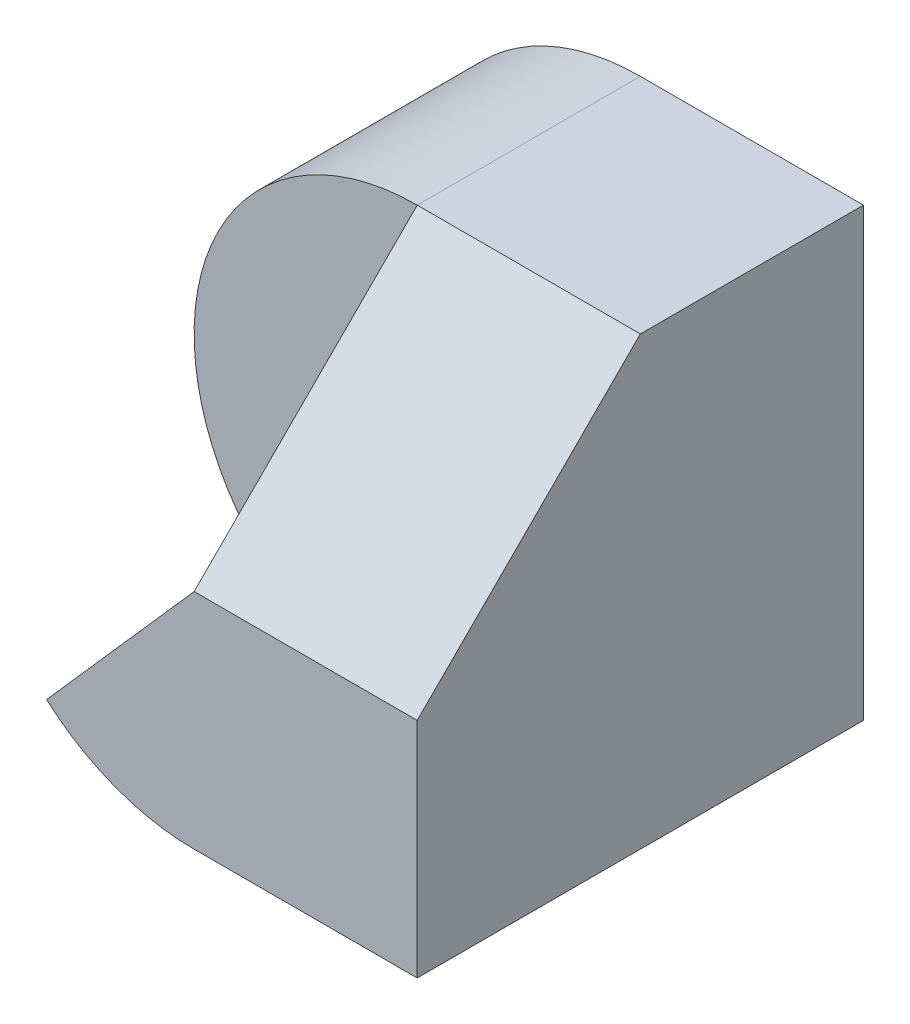
ISO-10303-21;
HEADER;
FILE_DESCRIPTION(('STEP AP214'),'2;1');
FILE_NAME('part.step','',(''),(''),'','','');
FILE_SCHEMA(('AUTOMOTIVE_DESIGN { 1 0 10303 214 1 1 1 1 }'));
ENDSEC;
DATA;
#1=APPLICATION_CONTEXT('core data for automotive mechanical design processes');
#2=APPLICATION_PROTOCOL_DEFINITION('international standard','automotive_design',2000,#1);
#3=PRODUCT_CONTEXT('',#1,'mechanical');
#4=PRODUCT('Part','Part','',(#3));
#5=PRODUCT_RELATED_PRODUCT_CATEGORY('part','',(#4));
#6=PRODUCT_DEFINITION_FORMATION('','',#4);
#7=PRODUCT_DEFINITION_CONTEXT('part definition',#1,'design');
#8=PRODUCT_DEFINITION('design','',#6,#7);
#9=PRODUCT_DEFINITION_SHAPE('','',#8);
#10=(LENGTH_UNIT() NAMED_UNIT(*) SI_UNIT(.MILLI.,.METRE.));
#11=(NAMED_UNIT(*) PLANE_ANGLE_UNIT() SI_UNIT($,.RADIAN.));
#12=(NAMED_UNIT(*) SI_UNIT($,.STERADIAN.) SOLID_ANGLE_UNIT());
#13=UNCERTAINTY_MEASURE_WITH_UNIT(LENGTH_MEASURE(1.E-05),#10,'distance_accuracy_value','');
#14=(GEOMETRIC_REPRESENTATION_CONTEXT(3) GLOBAL_UNCERTAINTY_ASSIGNED_CONTEXT((#13)) GLOBAL_UNIT_ASSIGNED_CONTEXT((#10,
#11,#12)) REPRESENTATION_CONTEXT('',''));
#15=CARTESIAN_POINT('',(0.,0.,0.));
#16=DIRECTION('',(0.,0.,1.));
#17=DIRECTION('',(1.,0.,0.));
#18=AXIS2_PLACEMENT_3D('',#15,#16,#17);
#19=CARTESIAN_POINT('',(0.,0.,40.));
#20=DIRECTION('',(0.,0.,-1.));
#21=DIRECTION('',(-1.,0.,0.));
#22=AXIS2_PLACEMENT_3D('',#19,#20,#21);
#23=PLANE('',#22);
#24=DIRECTION('',(-0.661437827766148,-0.75,0.));
#25=VECTOR('',#24,1.);
#26=CARTESIAN_POINT('',(1.32843258350778,-1.17156741649221,40.));
#27=LINE('',#26,#25);
#28=CARTESIAN_POINT('',(20.,20.,40.));
#29=VERTEX_POINT('',#28);
#30=CARTESIAN_POINT('',(6.77124344467704,5.,40.));
#31=VERTEX_POINT('',#30);
#32=EDGE_CURVE('E117',#29,#31,#27,.T.);
#33=ORIENTED_EDGE('',*,*,#32,.T.);
#34=CARTESIAN_POINT('',(20.,20.,40.));
#35=DIRECTION('',(0.,0.,1.));
#36=DIRECTION('',(1.,0.,0.));
#37=AXIS2_PLACEMENT_3D('',#34,#35,#36);
#38=CIRCLE('',#37,20.);
#39=CARTESIAN_POINT('',(20.,0.,40.));
#40=VERTEX_POINT('',#39);
#41=EDGE_CURVE('E95',#31,#40,#38,.T.);
#42=ORIENTED_EDGE('',*,*,#41,.T.);
#43=DIRECTION('',(1.,0.,0.));
#44=VECTOR('',#43,1.);
#45=CARTESIAN_POINT('',(0.,0.,40.));
#46=LINE('',#45,#44);
#47=CARTESIAN_POINT('',(40.,0.,40.));
#48=VERTEX_POINT('',#47);
#49=EDGE_CURVE('E75',#40,#48,#46,.T.);
#50=ORIENTED_EDGE('',*,*,#49,.T.);
#51=DIRECTION('',(0.,1.,0.));
#52=VECTOR('',#51,1.);
#53=CARTESIAN_POINT('',(40.,0.,40.));
#54=LINE('',#53,#52);
#55=CARTESIAN_POINT('',(40.,20.,40.));
#56=VERTEX_POINT('',#55);
#57=EDGE_CURVE('E119',#48,#56,#54,.T.);
#58=ORIENTED_EDGE('',*,*,#57,.T.);
#59=DIRECTION('',(-1.,0.,0.));
#60=VECTOR('',#59,1.);
#61=CARTESIAN_POINT('',(40.,20.,40.));
#62=LINE('',#61,#60);
#63=EDGE_CURVE('E115',#56,#29,#62,.T.);
#64=ORIENTED_EDGE('',*,*,#63,.T.);
#65=EDGE_LOOP('',(#33,#42,#50,#58,#64));
#66=FACE_BOUND('',#65,.T.);
#67=ADVANCED_FACE('F51',(#66),#23,.F.);
#68=CARTESIAN_POINT('',(20.,20.,0.));
#69=DIRECTION('',(0.,0.,1.));
#70=DIRECTION('',(1.,0.,0.));
#71=AXIS2_PLACEMENT_3D('',#68,#69,#70);
#72=CYLINDRICAL_SURFACE('',#71,20.);
#73=ORIENTED_EDGE('',*,*,#41,.F.);
#74=DIRECTION('',(0.,0.,1.));
#75=VECTOR('',#74,1.);
#76=CARTESIAN_POINT('',(6.77124344467704,5.,20.));
#77=LINE('',#76,#75);
#78=CARTESIAN_POINT('',(6.77124344467704,5.,20.));
#79=VERTEX_POINT('',#78);
#80=EDGE_CURVE('E135',#79,#31,#77,.T.);
#81=ORIENTED_EDGE('',*,*,#80,.F.);
#82=CARTESIAN_POINT('',(20.,20.,20.));
#83=DIRECTION('',(0.,0.,-1.));
#84=DIRECTION('',(-1.,0.,0.));
#85=AXIS2_PLACEMENT_3D('',#82,#83,#84);
#86=CIRCLE('',#85,20.);
#87=CARTESIAN_POINT('',(20.,40.,20.));
#88=VERTEX_POINT('',#87);
#89=EDGE_CURVE('E12',#88,#79,#86,.F.);
#90=ORIENTED_EDGE('',*,*,#89,.F.);
#91=DIRECTION('',(0.,0.,1.));
#92=VECTOR('',#91,1.);
#93=CARTESIAN_POINT('',(20.,40.,0.));
#94=LINE('',#93,#92);
#95=CARTESIAN_POINT('',(20.,40.,0.));
#96=VERTEX_POINT('',#95);
#97=EDGE_CURVE('E66',#96,#88,#94,.T.);
#98=ORIENTED_EDGE('',*,*,#97,.F.);
#99=CARTESIAN_POINT('',(20.,20.,0.));
#100=DIRECTION('',(0.,0.,1.));
#101=DIRECTION('',(1.,0.,0.));
#102=AXIS2_PLACEMENT_3D('',#99,#100,#101);
#103=CIRCLE('',#102,20.);
#104=CARTESIAN_POINT('',(20.,0.,0.));
#105=VERTEX_POINT('',#104);
#106=EDGE_CURVE('E91',#96,#105,#103,.T.);
#107=ORIENTED_EDGE('',*,*,#106,.T.);
#108=DIRECTION('',(0.,0.,1.));
#109=VECTOR('',#108,1.);
#110=CARTESIAN_POINT('',(20.,0.,0.));
#111=LINE('',#110,#109);
#112=EDGE_CURVE('E124',#105,#40,#111,.T.);
#113=ORIENTED_EDGE('',*,*,#112,.T.);
#114=EDGE_LOOP('',(#73,#81,#90,#98,#107,#113));
#115=FACE_BOUND('',#114,.T.);
#116=ADVANCED_FACE('F178',(#115),#72,.T.);
#117=CARTESIAN_POINT('',(40.,0.,40.));
#118=DIRECTION('',(-1.,0.,0.));
#119=DIRECTION('',(0.,0.,1.));
#120=AXIS2_PLACEMENT_3D('',#117,#118,#119);
#121=PLANE('',#120);
#122=DIRECTION('',(0.,0.,-1.));
#123=VECTOR('',#122,1.);
#124=CARTESIAN_POINT('',(40.,40.,40.));
#125=LINE('',#124,#123);
#126=CARTESIAN_POINT('',(40.,40.,20.));
#127=VERTEX_POINT('',#126);
#128=CARTESIAN_POINT('',(40.,40.,0.));
#129=VERTEX_POINT('',#128);
#130=EDGE_CURVE('E157',#127,#129,#125,.T.);
#131=ORIENTED_EDGE('',*,*,#130,.F.);
#132=DIRECTION('',(0.,-0.707106781186548,0.707106781186548));
#133=VECTOR('',#132,1.);
#134=CARTESIAN_POINT('',(40.,40.,20.));
#135=LINE('',#134,#133);
#136=EDGE_CURVE('E173',#127,#56,#135,.T.);
#137=ORIENTED_EDGE('',*,*,#136,.T.);
#138=ORIENTED_EDGE('',*,*,#57,.F.);
#139=DIRECTION('',(0.,0.,-1.));
#140=VECTOR('',#139,1.);
#141=CARTESIAN_POINT('',(40.,0.,40.));
#142=LINE('',#141,#140);
#143=CARTESIAN_POINT('',(40.,0.,0.));
#144=VERTEX_POINT('',#143);
#145=EDGE_CURVE('E59',#48,#144,#142,.T.);
#146=ORIENTED_EDGE('',*,*,#145,.T.);
#147=DIRECTION('',(0.,1.,0.));
#148=VECTOR('',#147,1.);
#149=CARTESIAN_POINT('',(40.,0.,0.));
#150=LINE('',#149,#148);
#151=EDGE_CURVE('E159',#144,#129,#150,.T.);
#152=ORIENTED_EDGE('',*,*,#151,.T.);
#153=EDGE_LOOP('',(#131,#137,#138,#146,#152));
#154=FACE_BOUND('',#153,.T.);
#155=ADVANCED_FACE('F167',(#154),#121,.F.);
#156=CARTESIAN_POINT('',(0.,40.,40.));
#157=DIRECTION('',(0.,-1.,0.));
#158=DIRECTION('',(0.,0.,-1.));
#159=AXIS2_PLACEMENT_3D('',#156,#157,#158);
#160=PLANE('',#159);
#161=DIRECTION('',(-1.,0.,0.));
#162=VECTOR('',#161,1.);
#163=CARTESIAN_POINT('',(40.,40.,20.));
#164=LINE('',#163,#162);
#165=EDGE_CURVE('E125',#127,#88,#164,.T.);
#166=ORIENTED_EDGE('',*,*,#165,.F.);
#167=ORIENTED_EDGE('',*,*,#130,.T.);
#168=DIRECTION('',(-1.,0.,0.));
#169=VECTOR('',#168,1.);
#170=CARTESIAN_POINT('',(0.,40.,0.));
#171=LINE('',#170,#169);
#172=EDGE_CURVE('E155',#129,#96,#171,.T.);
#173=ORIENTED_EDGE('',*,*,#172,.T.);
#174=ORIENTED_EDGE('',*,*,#97,.T.);
#175=EDGE_LOOP('',(#166,#167,#173,#174));
#176=FACE_BOUND('',#175,.T.);
#177=ADVANCED_FACE('F172',(#176),#160,.F.);
#178=CARTESIAN_POINT('',(0.,0.,0.));
#179=DIRECTION('',(0.,0.,-1.));
#180=DIRECTION('',(-1.,0.,0.));
#181=AXIS2_PLACEMENT_3D('',#178,#179,#180);
#182=PLANE('',#181);
#183=DIRECTION('',(1.,0.,0.));
#184=VECTOR('',#183,1.);
#185=CARTESIAN_POINT('',(0.,0.,0.));
#186=LINE('',#185,#184);
#187=EDGE_CURVE('E87',#105,#144,#186,.T.);
#188=ORIENTED_EDGE('',*,*,#187,.F.);
#189=ORIENTED_EDGE('',*,*,#106,.F.);
#190=ORIENTED_EDGE('',*,*,#172,.F.);
#191=ORIENTED_EDGE('',*,*,#151,.F.);
#192=EDGE_LOOP('',(#188,#189,#190,#191));
#193=FACE_BOUND('',#192,.T.);
#194=ADVANCED_FACE('F170',(#193),#182,.T.);
#195=CARTESIAN_POINT('',(0.,0.,40.));
#196=DIRECTION('',(0.,1.,0.));
#197=DIRECTION('',(0.,0.,1.));
#198=AXIS2_PLACEMENT_3D('',#195,#196,#197);
#199=PLANE('',#198);
#200=ORIENTED_EDGE('',*,*,#112,.F.);
#201=ORIENTED_EDGE('',*,*,#187,.T.);
#202=ORIENTED_EDGE('',*,*,#145,.F.);
#203=ORIENTED_EDGE('',*,*,#49,.F.);
#204=EDGE_LOOP('',(#200,#201,#202,#203));
#205=FACE_BOUND('',#204,.T.);
#206=ADVANCED_FACE('F53',(#205),#199,.F.);
#207=CARTESIAN_POINT('',(0.,0.,20.));
#208=DIRECTION('',(0.,0.,-1.));
#209=DIRECTION('',(-1.,0.,0.));
#210=AXIS2_PLACEMENT_3D('',#207,#208,#209);
#211=PLANE('',#210);
#212=DIRECTION('',(-0.661437827766148,-0.75,0.));
#213=VECTOR('',#212,1.);
#214=CARTESIAN_POINT('',(1.32843258350778,-1.17156741649221,20.));
#215=LINE('',#214,#213);
#216=CARTESIAN_POINT('',(20.,20.,20.));
#217=VERTEX_POINT('',#216);
#218=EDGE_CURVE('E136',#217,#79,#215,.T.);
#219=ORIENTED_EDGE('',*,*,#218,.F.);
#220=DIRECTION('',(0.,1.,0.));
#221=VECTOR('',#220,1.);
#222=CARTESIAN_POINT('',(20.,20.,20.));
#223=LINE('',#222,#221);
#224=EDGE_CURVE('E143',#217,#88,#223,.T.);
#225=ORIENTED_EDGE('',*,*,#224,.T.);
#226=ORIENTED_EDGE('',*,*,#89,.T.);
#227=EDGE_LOOP('',(#219,#225,#226));
#228=FACE_BOUND('',#227,.T.);
#229=ADVANCED_FACE('F180',(#228),#211,.F.);
#230=CARTESIAN_POINT('',(1.32843258350778,-1.17156741649221,20.));
#231=DIRECTION('',(-0.75,0.661437827766148,0.));
#232=DIRECTION('',(-0.661437827766148,-0.75,0.));
#233=AXIS2_PLACEMENT_3D('',#230,#231,#232);
#234=PLANE('',#233);
#235=ORIENTED_EDGE('',*,*,#32,.F.);
#236=DIRECTION('',(0.,0.,1.));
#237=VECTOR('',#236,1.);
#238=CARTESIAN_POINT('',(20.,20.,20.));
#239=LINE('',#238,#237);
#240=EDGE_CURVE('E132',#217,#29,#239,.T.);
#241=ORIENTED_EDGE('',*,*,#240,.F.);
#242=ORIENTED_EDGE('',*,*,#218,.T.);
#243=ORIENTED_EDGE('',*,*,#80,.T.);
#244=EDGE_LOOP('',(#235,#241,#242,#243));
#245=FACE_BOUND('',#244,.T.);
#246=ADVANCED_FACE('F129',(#245),#234,.T.);
#247=CARTESIAN_POINT('',(20.,40.,20.));
#248=DIRECTION('',(0.,0.707106781186548,0.707106781186548));
#249=DIRECTION('',(0.,-0.707106781186548,0.707106781186548));
#250=AXIS2_PLACEMENT_3D('',#247,#248,#249);
#251=PLANE('',#250);
#252=ORIENTED_EDGE('',*,*,#136,.F.);
#253=ORIENTED_EDGE('',*,*,#165,.T.);
#254=DIRECTION('',(0.,-0.707106781186548,0.707106781186548));
#255=VECTOR('',#254,1.);
#256=CARTESIAN_POINT('',(20.,40.,20.));
#257=LINE('',#256,#255);
#258=EDGE_CURVE('E137',#88,#29,#257,.T.);
#259=ORIENTED_EDGE('',*,*,#258,.T.);
#260=ORIENTED_EDGE('',*,*,#63,.F.);
#261=EDGE_LOOP('',(#252,#253,#259,#260));
#262=FACE_BOUND('',#261,.T.);
#263=ADVANCED_FACE('F141',(#262),#251,.T.);
#264=CARTESIAN_POINT('',(20.,0.,0.));
#265=DIRECTION('',(-1.,0.,0.));
#266=DIRECTION('',(0.,0.,1.));
#267=AXIS2_PLACEMENT_3D('',#264,#265,#266);
#268=PLANE('',#267);
#269=ORIENTED_EDGE('',*,*,#224,.F.);
#270=ORIENTED_EDGE('',*,*,#240,.T.);
#271=ORIENTED_EDGE('',*,*,#258,.F.);
#272=EDGE_LOOP('',(#269,#270,#271));
#273=FACE_BOUND('',#272,.T.);
#274=ADVANCED_FACE('F145',(#273),#268,.T.);
#275=CLOSED_SHELL('',(#67,#116,#155,#177,#194,#206,#229,#246,#263,#274));
#276=MANIFOLD_SOLID_BREP('B2',#275);
#277=ADVANCED_BREP_SHAPE_REPRESENTATION('',(#18,#276),#14);
#278=SHAPE_DEFINITION_REPRESENTATION(#9,#277);
ENDSEC;
END-ISO-10303-21;
